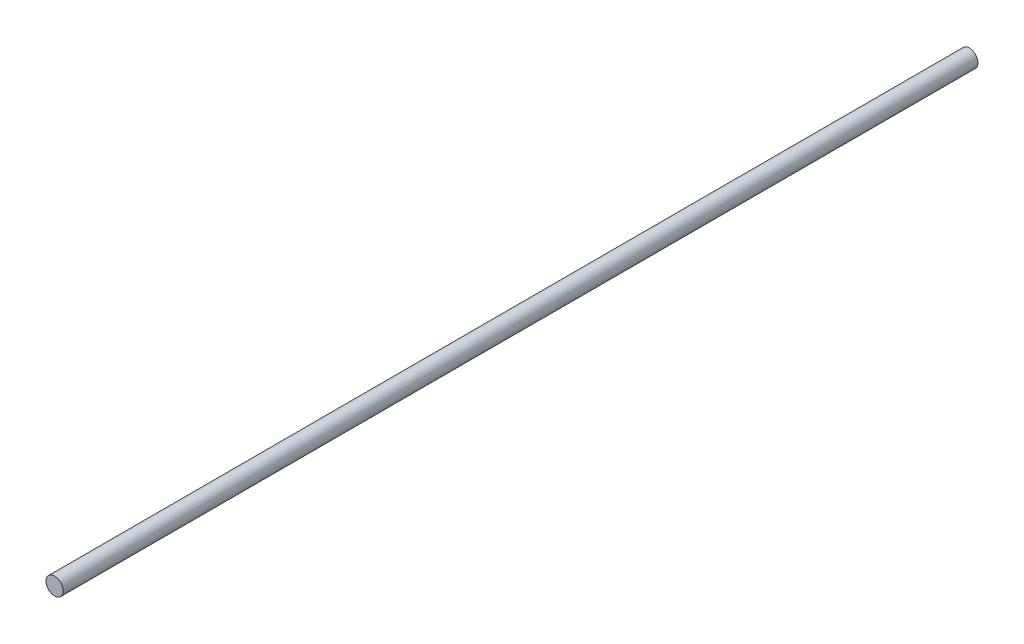
ISO-10303-21;
HEADER;
FILE_DESCRIPTION(('STEP AP214'),'2;1');
FILE_NAME('part.step','',(''),(''),'','','');
FILE_SCHEMA(('AUTOMOTIVE_DESIGN { 1 0 10303 214 1 1 1 1 }'));
ENDSEC;
DATA;
#1=APPLICATION_CONTEXT('core data for automotive mechanical design processes');
#2=APPLICATION_PROTOCOL_DEFINITION('international standard','automotive_design',2000,#1);
#3=PRODUCT_CONTEXT('',#1,'mechanical');
#4=PRODUCT('Part','Part','',(#3));
#5=PRODUCT_RELATED_PRODUCT_CATEGORY('part','',(#4));
#6=PRODUCT_DEFINITION_FORMATION('','',#4);
#7=PRODUCT_DEFINITION_CONTEXT('part definition',#1,'design');
#8=PRODUCT_DEFINITION('design','',#6,#7);
#9=PRODUCT_DEFINITION_SHAPE('','',#8);
#10=(LENGTH_UNIT() NAMED_UNIT(*) SI_UNIT(.MILLI.,.METRE.));
#11=(NAMED_UNIT(*) PLANE_ANGLE_UNIT() SI_UNIT($,.RADIAN.));
#12=(NAMED_UNIT(*) SI_UNIT($,.STERADIAN.) SOLID_ANGLE_UNIT());
#13=UNCERTAINTY_MEASURE_WITH_UNIT(LENGTH_MEASURE(1.E-05),#10,'distance_accuracy_value','');
#14=(GEOMETRIC_REPRESENTATION_CONTEXT(3) GLOBAL_UNCERTAINTY_ASSIGNED_CONTEXT((#13)) GLOBAL_UNIT_ASSIGNED_CONTEXT((#10,
#11,#12)) REPRESENTATION_CONTEXT('',''));
#15=CARTESIAN_POINT('',(0.,0.,0.));
#16=DIRECTION('',(0.,0.,1.));
#17=DIRECTION('',(1.,0.,0.));
#18=AXIS2_PLACEMENT_3D('',#15,#16,#17);
#19=CARTESIAN_POINT('',(0.,0.,425.));
#20=DIRECTION('',(0.,0.,-1.));
#21=DIRECTION('',(-1.,0.,0.));
#22=AXIS2_PLACEMENT_3D('',#19,#20,#21);
#23=CYLINDRICAL_SURFACE('',#22,4.);
#24=CARTESIAN_POINT('',(0.,0.,425.));
#25=DIRECTION('',(0.,0.,1.));
#26=DIRECTION('',(1.,0.,0.));
#27=AXIS2_PLACEMENT_3D('',#24,#25,#26);
#28=CIRCLE('',#27,4.);
#29=CARTESIAN_POINT('',(4.,0.,425.));
#30=VERTEX_POINT('',#29);
#31=EDGE_CURVE('E10',#30,#30,#28,.T.);
#32=ORIENTED_EDGE('',*,*,#31,.F.);
#33=EDGE_LOOP('',(#32));
#34=FACE_BOUND('',#33,.T.);
#35=CARTESIAN_POINT('',(0.,0.,0.));
#36=DIRECTION('',(0.,0.,1.));
#37=DIRECTION('',(1.,0.,0.));
#38=AXIS2_PLACEMENT_3D('',#35,#36,#37);
#39=CIRCLE('',#38,4.);
#40=CARTESIAN_POINT('',(4.,0.,0.));
#41=VERTEX_POINT('',#40);
#42=EDGE_CURVE('E37',#41,#41,#39,.T.);
#43=ORIENTED_EDGE('',*,*,#42,.T.);
#44=EDGE_LOOP('',(#43));
#45=FACE_BOUND('',#44,.T.);
#46=ADVANCED_FACE('F34',(#34,#45),#23,.T.);
#47=CARTESIAN_POINT('',(0.,0.,425.));
#48=DIRECTION('',(0.,0.,1.));
#49=DIRECTION('',(1.,0.,0.));
#50=AXIS2_PLACEMENT_3D('',#47,#48,#49);
#51=PLANE('',#50);
#52=ORIENTED_EDGE('',*,*,#31,.T.);
#53=EDGE_LOOP('',(#52));
#54=FACE_BOUND('',#53,.T.);
#55=ADVANCED_FACE('F49',(#54),#51,.T.);
#56=CARTESIAN_POINT('',(0.,0.,0.));
#57=DIRECTION('',(0.,0.,1.));
#58=DIRECTION('',(1.,0.,0.));
#59=AXIS2_PLACEMENT_3D('',#56,#57,#58);
#60=PLANE('',#59);
#61=ORIENTED_EDGE('',*,*,#42,.F.);
#62=EDGE_LOOP('',(#61));
#63=FACE_BOUND('',#62,.T.);
#64=ADVANCED_FACE('F47',(#63),#60,.F.);
#65=CLOSED_SHELL('',(#46,#55,#64));
#66=MANIFOLD_SOLID_BREP('B2',#65);
#67=ADVANCED_BREP_SHAPE_REPRESENTATION('',(#18,#66),#14);
#68=SHAPE_DEFINITION_REPRESENTATION(#9,#67);
ENDSEC;
END-ISO-10303-21;
